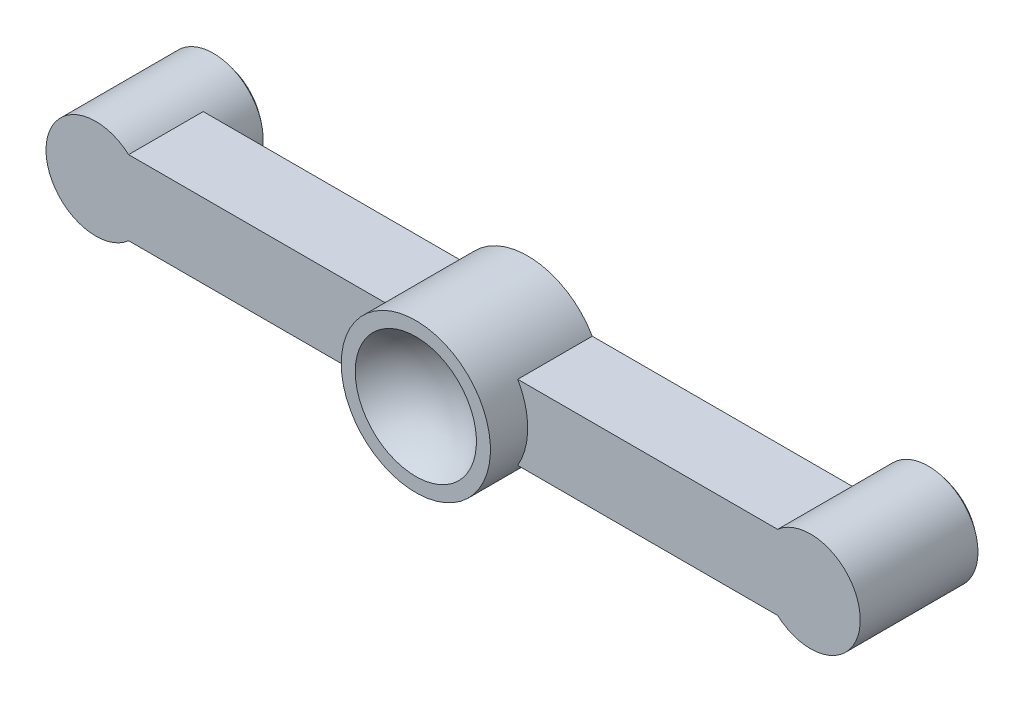
ISO-10303-21;
HEADER;
FILE_DESCRIPTION(('STEP AP214'),'2;1');
FILE_NAME('part.step','',(''),(''),'','','');
FILE_SCHEMA(('AUTOMOTIVE_DESIGN { 1 0 10303 214 1 1 1 1 }'));
ENDSEC;
DATA;
#1=APPLICATION_CONTEXT('core data for automotive mechanical design processes');
#2=APPLICATION_PROTOCOL_DEFINITION('international standard','automotive_design',2000,#1);
#3=PRODUCT_CONTEXT('',#1,'mechanical');
#4=PRODUCT('Part','Part','',(#3));
#5=PRODUCT_RELATED_PRODUCT_CATEGORY('part','',(#4));
#6=PRODUCT_DEFINITION_FORMATION('','',#4);
#7=PRODUCT_DEFINITION_CONTEXT('part definition',#1,'design');
#8=PRODUCT_DEFINITION('design','',#6,#7);
#9=PRODUCT_DEFINITION_SHAPE('','',#8);
#10=(LENGTH_UNIT() NAMED_UNIT(*) SI_UNIT(.MILLI.,.METRE.));
#11=(NAMED_UNIT(*) PLANE_ANGLE_UNIT() SI_UNIT($,.RADIAN.));
#12=(NAMED_UNIT(*) SI_UNIT($,.STERADIAN.) SOLID_ANGLE_UNIT());
#13=UNCERTAINTY_MEASURE_WITH_UNIT(LENGTH_MEASURE(1.E-05),#10,'distance_accuracy_value','');
#14=(GEOMETRIC_REPRESENTATION_CONTEXT(3) GLOBAL_UNCERTAINTY_ASSIGNED_CONTEXT((#13)) GLOBAL_UNIT_ASSIGNED_CONTEXT((#10,
#11,#12)) REPRESENTATION_CONTEXT('',''));
#15=CARTESIAN_POINT('',(0.,0.,0.));
#16=DIRECTION('',(0.,0.,1.));
#17=DIRECTION('',(1.,0.,0.));
#18=AXIS2_PLACEMENT_3D('',#15,#16,#17);
#19=CARTESIAN_POINT('',(0.,0.,12.));
#20=DIRECTION('',(0.,0.,1.));
#21=DIRECTION('',(1.,0.,0.));
#22=AXIS2_PLACEMENT_3D('',#19,#20,#21);
#23=PLANE('',#22);
#24=DIRECTION('',(1.,0.,0.));
#25=VECTOR('',#24,1.);
#26=CARTESIAN_POINT('',(0.,5.99999999999999,12.));
#27=LINE('',#26,#25);
#28=CARTESIAN_POINT('',(67.8923048454133,6.,12.));
#29=VERTEX_POINT('',#28);
#30=CARTESIAN_POINT('',(109.708497377871,6.00000000000001,12.));
#31=VERTEX_POINT('',#30);
#32=EDGE_CURVE('E156',#29,#31,#27,.T.);
#33=ORIENTED_EDGE('',*,*,#32,.F.);
#34=CARTESIAN_POINT('',(57.5,0.,12.));
#35=DIRECTION('',(0.,0.,-1.));
#36=DIRECTION('',(-1.,0.,0.));
#37=AXIS2_PLACEMENT_3D('',#34,#35,#36);
#38=CIRCLE('',#37,12.);
#39=CARTESIAN_POINT('',(67.8923048454133,-5.99999999999999,12.));
#40=VERTEX_POINT('',#39);
#41=EDGE_CURVE('E12',#29,#40,#38,.T.);
#42=ORIENTED_EDGE('',*,*,#41,.T.);
#43=DIRECTION('',(1.,0.,0.));
#44=VECTOR('',#43,1.);
#45=CARTESIAN_POINT('',(0.,-5.99999999999999,12.));
#46=LINE('',#45,#44);
#47=CARTESIAN_POINT('',(109.708497377871,-5.99999999999999,12.));
#48=VERTEX_POINT('',#47);
#49=EDGE_CURVE('E155',#40,#48,#46,.T.);
#50=ORIENTED_EDGE('',*,*,#49,.T.);
#51=CARTESIAN_POINT('',(115.,0.,12.));
#52=DIRECTION('',(0.,0.,1.));
#53=DIRECTION('',(1.,0.,0.));
#54=AXIS2_PLACEMENT_3D('',#51,#52,#53);
#55=CIRCLE('',#54,8.);
#56=EDGE_CURVE('E172',#48,#31,#55,.T.);
#57=ORIENTED_EDGE('',*,*,#56,.T.);
#58=EDGE_LOOP('',(#33,#42,#50,#57));
#59=FACE_BOUND('',#58,.T.);
#60=ADVANCED_FACE('F81',(#59),#23,.T.);
#61=CARTESIAN_POINT('',(0.,0.,0.));
#62=DIRECTION('',(0.,0.,1.));
#63=DIRECTION('',(1.,0.,0.));
#64=AXIS2_PLACEMENT_3D('',#61,#62,#63);
#65=PLANE('',#64);
#66=CARTESIAN_POINT('',(115.,0.,0.));
#67=DIRECTION('',(0.,0.,1.));
#68=DIRECTION('',(1.,0.,0.));
#69=AXIS2_PLACEMENT_3D('',#66,#67,#68);
#70=CIRCLE('',#69,8.);
#71=CARTESIAN_POINT('',(109.708497377871,6.00000000000001,0.));
#72=VERTEX_POINT('',#71);
#73=CARTESIAN_POINT('',(109.708497377871,-5.99999999999999,0.));
#74=VERTEX_POINT('',#73);
#75=EDGE_CURVE('E203',#72,#74,#70,.T.);
#76=ORIENTED_EDGE('',*,*,#75,.T.);
#77=DIRECTION('',(1.,0.,0.));
#78=VECTOR('',#77,1.);
#79=CARTESIAN_POINT('',(0.,-5.99999999999999,0.));
#80=LINE('',#79,#78);
#81=CARTESIAN_POINT('',(67.8923048454133,-5.99999999999999,0.));
#82=VERTEX_POINT('',#81);
#83=EDGE_CURVE('E187',#82,#74,#80,.T.);
#84=ORIENTED_EDGE('',*,*,#83,.F.);
#85=CARTESIAN_POINT('',(57.5,0.,0.));
#86=DIRECTION('',(0.,0.,1.));
#87=DIRECTION('',(1.,0.,0.));
#88=AXIS2_PLACEMENT_3D('',#85,#86,#87);
#89=CIRCLE('',#88,12.);
#90=CARTESIAN_POINT('',(47.1076951545867,-5.99999999999999,0.));
#91=VERTEX_POINT('',#90);
#92=EDGE_CURVE('E201',#91,#82,#89,.T.);
#93=ORIENTED_EDGE('',*,*,#92,.F.);
#94=CARTESIAN_POINT('',(5.2915026221292,-5.99999999999999,0.));
#95=VERTEX_POINT('',#94);
#96=EDGE_CURVE('E189',#95,#91,#80,.T.);
#97=ORIENTED_EDGE('',*,*,#96,.F.);
#98=CARTESIAN_POINT('',(0.,0.,0.));
#99=DIRECTION('',(0.,0.,-1.));
#100=DIRECTION('',(-1.,0.,0.));
#101=AXIS2_PLACEMENT_3D('',#98,#99,#100);
#102=CIRCLE('',#101,8.);
#103=CARTESIAN_POINT('',(5.2915026221292,5.99999999999999,0.));
#104=VERTEX_POINT('',#103);
#105=EDGE_CURVE('E223',#104,#95,#102,.T.);
#106=ORIENTED_EDGE('',*,*,#105,.F.);
#107=DIRECTION('',(1.,0.,0.));
#108=VECTOR('',#107,1.);
#109=CARTESIAN_POINT('',(0.,5.99999999999999,0.));
#110=LINE('',#109,#108);
#111=CARTESIAN_POINT('',(47.1076951545867,6.,0.));
#112=VERTEX_POINT('',#111);
#113=EDGE_CURVE('E186',#104,#112,#110,.T.);
#114=ORIENTED_EDGE('',*,*,#113,.T.);
#115=CARTESIAN_POINT('',(67.8923048454133,6.,0.));
#116=VERTEX_POINT('',#115);
#117=EDGE_CURVE('E160',#116,#112,#89,.T.);
#118=ORIENTED_EDGE('',*,*,#117,.F.);
#119=EDGE_CURVE('E188',#116,#72,#110,.T.);
#120=ORIENTED_EDGE('',*,*,#119,.T.);
#121=EDGE_LOOP('',(#76,#84,#93,#97,#106,#114,#118,#120));
#122=FACE_BOUND('',#121,.T.);
#123=ADVANCED_FACE('F200',(#122),#65,.F.);
#124=CARTESIAN_POINT('',(5.2915026221292,-5.99999999999999,12.));
#125=VERTEX_POINT('',#124);
#126=CARTESIAN_POINT('',(47.1076951545867,-5.99999999999999,12.));
#127=VERTEX_POINT('',#126);
#128=EDGE_CURVE('E143',#125,#127,#46,.T.);
#129=ORIENTED_EDGE('',*,*,#128,.T.);
#130=CARTESIAN_POINT('',(47.1076951545867,6.,12.));
#131=VERTEX_POINT('',#130);
#132=EDGE_CURVE('E91',#127,#131,#38,.T.);
#133=ORIENTED_EDGE('',*,*,#132,.T.);
#134=CARTESIAN_POINT('',(5.29150262212919,5.99999999999999,12.));
#135=VERTEX_POINT('',#134);
#136=EDGE_CURVE('E141',#135,#131,#27,.T.);
#137=ORIENTED_EDGE('',*,*,#136,.F.);
#138=CARTESIAN_POINT('',(0.,0.,12.));
#139=DIRECTION('',(0.,0.,1.));
#140=DIRECTION('',(1.,0.,0.));
#141=AXIS2_PLACEMENT_3D('',#138,#139,#140);
#142=CIRCLE('',#141,8.);
#143=EDGE_CURVE('E176',#135,#125,#142,.T.);
#144=ORIENTED_EDGE('',*,*,#143,.T.);
#145=EDGE_LOOP('',(#129,#133,#137,#144));
#146=FACE_BOUND('',#145,.T.);
#147=ADVANCED_FACE('F139',(#146),#23,.T.);
#148=CARTESIAN_POINT('',(0.,0.,12.));
#149=DIRECTION('',(0.,0.,-1.));
#150=DIRECTION('',(-1.,0.,0.));
#151=AXIS2_PLACEMENT_3D('',#148,#149,#150);
#152=CYLINDRICAL_SURFACE('',#151,8.);
#153=ORIENTED_EDGE('',*,*,#143,.F.);
#154=DIRECTION('',(0.,0.,-1.));
#155=VECTOR('',#154,1.);
#156=CARTESIAN_POINT('',(5.29150262212919,5.99999999999999,12.));
#157=LINE('',#156,#155);
#158=EDGE_CURVE('E85',#135,#104,#157,.T.);
#159=ORIENTED_EDGE('',*,*,#158,.T.);
#160=ORIENTED_EDGE('',*,*,#105,.T.);
#161=DIRECTION('',(0.,0.,-1.));
#162=VECTOR('',#161,1.);
#163=CARTESIAN_POINT('',(5.2915026221292,-5.99999999999999,12.));
#164=LINE('',#163,#162);
#165=EDGE_CURVE('E100',#125,#95,#164,.T.);
#166=ORIENTED_EDGE('',*,*,#165,.F.);
#167=EDGE_LOOP('',(#153,#159,#160,#166));
#168=FACE_BOUND('',#167,.T.);
#169=CARTESIAN_POINT('',(0.,0.,-6.94427190999916));
#170=DIRECTION('',(0.,0.,-1.));
#171=DIRECTION('',(-1.,0.,0.));
#172=AXIS2_PLACEMENT_3D('',#169,#170,#171);
#173=CIRCLE('',#172,8.);
#174=CARTESIAN_POINT('',(-8.,0.,-6.94427190999916));
#175=VERTEX_POINT('',#174);
#176=EDGE_CURVE('E182',#175,#175,#173,.T.);
#177=ORIENTED_EDGE('',*,*,#176,.F.);
#178=EDGE_LOOP('',(#177));
#179=FACE_BOUND('',#178,.T.);
#180=ADVANCED_FACE('F224',(#168,#179),#152,.T.);
#181=CARTESIAN_POINT('',(115.,0.,12.));
#182=DIRECTION('',(0.,0.,-1.));
#183=DIRECTION('',(-1.,0.,0.));
#184=AXIS2_PLACEMENT_3D('',#181,#182,#183);
#185=CYLINDRICAL_SURFACE('',#184,8.);
#186=DIRECTION('',(0.,0.,-1.));
#187=VECTOR('',#186,1.);
#188=CARTESIAN_POINT('',(109.708497377871,-5.99999999999999,12.));
#189=LINE('',#188,#187);
#190=EDGE_CURVE('E173',#74,#48,#189,.F.);
#191=ORIENTED_EDGE('',*,*,#190,.F.);
#192=ORIENTED_EDGE('',*,*,#75,.F.);
#193=DIRECTION('',(0.,0.,-1.));
#194=VECTOR('',#193,1.);
#195=CARTESIAN_POINT('',(109.708497377871,6.00000000000001,12.));
#196=LINE('',#195,#194);
#197=EDGE_CURVE('E175',#72,#31,#196,.F.);
#198=ORIENTED_EDGE('',*,*,#197,.T.);
#199=ORIENTED_EDGE('',*,*,#56,.F.);
#200=EDGE_LOOP('',(#191,#192,#198,#199));
#201=FACE_BOUND('',#200,.T.);
#202=CARTESIAN_POINT('',(115.,0.,-6.94427190999916));
#203=DIRECTION('',(0.,0.,1.));
#204=DIRECTION('',(1.,0.,0.));
#205=AXIS2_PLACEMENT_3D('',#202,#203,#204);
#206=CIRCLE('',#205,8.);
#207=CARTESIAN_POINT('',(123.,0.,-6.94427190999916));
#208=VERTEX_POINT('',#207);
#209=EDGE_CURVE('E207',#208,#208,#206,.T.);
#210=ORIENTED_EDGE('',*,*,#209,.T.);
#211=EDGE_LOOP('',(#210));
#212=FACE_BOUND('',#211,.T.);
#213=ADVANCED_FACE('F211',(#201,#212),#185,.T.);
#214=CARTESIAN_POINT('',(0.,5.99999999999999,12.));
#215=DIRECTION('',(0.,1.,0.));
#216=DIRECTION('',(-1.,0.,0.));
#217=AXIS2_PLACEMENT_3D('',#214,#215,#216);
#218=PLANE('',#217);
#219=ORIENTED_EDGE('',*,*,#197,.F.);
#220=ORIENTED_EDGE('',*,*,#119,.F.);
#221=DIRECTION('',(0.,0.,-1.));
#222=VECTOR('',#221,1.);
#223=CARTESIAN_POINT('',(67.8923048454133,6.,12.));
#224=LINE('',#223,#222);
#225=EDGE_CURVE('E161',#116,#29,#224,.F.);
#226=ORIENTED_EDGE('',*,*,#225,.T.);
#227=ORIENTED_EDGE('',*,*,#32,.T.);
#228=EDGE_LOOP('',(#219,#220,#226,#227));
#229=FACE_BOUND('',#228,.T.);
#230=ADVANCED_FACE('F268',(#229),#218,.T.);
#231=CARTESIAN_POINT('',(0.,-5.99999999999999,12.));
#232=DIRECTION('',(0.,1.,0.));
#233=DIRECTION('',(0.,0.,1.));
#234=AXIS2_PLACEMENT_3D('',#231,#232,#233);
#235=PLANE('',#234);
#236=ORIENTED_EDGE('',*,*,#83,.T.);
#237=ORIENTED_EDGE('',*,*,#190,.T.);
#238=ORIENTED_EDGE('',*,*,#49,.F.);
#239=DIRECTION('',(0.,0.,-1.));
#240=VECTOR('',#239,1.);
#241=CARTESIAN_POINT('',(67.8923048454133,-5.99999999999999,12.));
#242=LINE('',#241,#240);
#243=EDGE_CURVE('E131',#82,#40,#242,.F.);
#244=ORIENTED_EDGE('',*,*,#243,.F.);
#245=EDGE_LOOP('',(#236,#237,#238,#244));
#246=FACE_BOUND('',#245,.T.);
#247=ADVANCED_FACE('F193',(#246),#235,.F.);
#248=CARTESIAN_POINT('',(57.5,0.,12.));
#249=DIRECTION('',(0.,0.,-1.));
#250=DIRECTION('',(-1.,0.,0.));
#251=AXIS2_PLACEMENT_3D('',#248,#249,#250);
#252=CYLINDRICAL_SURFACE('',#251,12.);
#253=ORIENTED_EDGE('',*,*,#225,.F.);
#254=ORIENTED_EDGE('',*,*,#117,.T.);
#255=DIRECTION('',(0.,0.,-1.));
#256=VECTOR('',#255,1.);
#257=CARTESIAN_POINT('',(47.1076951545867,6.,12.));
#258=LINE('',#257,#256);
#259=EDGE_CURVE('E152',#131,#112,#258,.T.);
#260=ORIENTED_EDGE('',*,*,#259,.F.);
#261=ORIENTED_EDGE('',*,*,#132,.F.);
#262=DIRECTION('',(0.,0.,-1.));
#263=VECTOR('',#262,1.);
#264=CARTESIAN_POINT('',(47.1076951545867,-5.99999999999999,12.));
#265=LINE('',#264,#263);
#266=EDGE_CURVE('E164',#127,#91,#265,.T.);
#267=ORIENTED_EDGE('',*,*,#266,.T.);
#268=ORIENTED_EDGE('',*,*,#92,.T.);
#269=ORIENTED_EDGE('',*,*,#243,.T.);
#270=ORIENTED_EDGE('',*,*,#41,.F.);
#271=EDGE_LOOP('',(#253,#254,#260,#261,#267,#268,#269,#270));
#272=FACE_BOUND('',#271,.T.);
#273=CARTESIAN_POINT('',(57.5,0.,18.));
#274=DIRECTION('',(0.,0.,-1.));
#275=DIRECTION('',(-1.,0.,0.));
#276=AXIS2_PLACEMENT_3D('',#273,#274,#275);
#277=CIRCLE('',#276,12.);
#278=CARTESIAN_POINT('',(45.5,0.,18.));
#279=VERTEX_POINT('',#278);
#280=EDGE_CURVE('E208',#279,#279,#277,.T.);
#281=ORIENTED_EDGE('',*,*,#280,.T.);
#282=EDGE_LOOP('',(#281));
#283=FACE_BOUND('',#282,.T.);
#284=ADVANCED_FACE('F83',(#272,#283),#252,.T.);
#285=ORIENTED_EDGE('',*,*,#158,.F.);
#286=ORIENTED_EDGE('',*,*,#136,.T.);
#287=ORIENTED_EDGE('',*,*,#259,.T.);
#288=ORIENTED_EDGE('',*,*,#113,.F.);
#289=EDGE_LOOP('',(#285,#286,#287,#288));
#290=FACE_BOUND('',#289,.T.);
#291=ADVANCED_FACE('F150',(#290),#218,.T.);
#292=ORIENTED_EDGE('',*,*,#128,.F.);
#293=ORIENTED_EDGE('',*,*,#165,.T.);
#294=ORIENTED_EDGE('',*,*,#96,.T.);
#295=ORIENTED_EDGE('',*,*,#266,.F.);
#296=EDGE_LOOP('',(#292,#293,#294,#295));
#297=FACE_BOUND('',#296,.T.);
#298=ADVANCED_FACE('F261',(#297),#235,.F.);
#299=CARTESIAN_POINT('',(0.,0.,2.));
#300=DIRECTION('',(0.,0.,-1.));
#301=DIRECTION('',(-1.,0.,0.));
#302=AXIS2_PLACEMENT_3D('',#299,#300,#301);
#303=SPHERICAL_SURFACE('',#302,12.);
#304=ORIENTED_EDGE('',*,*,#176,.T.);
#305=EDGE_LOOP('',(#304));
#306=FACE_BOUND('',#305,.T.);
#307=ADVANCED_FACE('F255',(#306),#303,.T.);
#308=CARTESIAN_POINT('',(115.,0.,2.));
#309=DIRECTION('',(0.,0.,-1.));
#310=DIRECTION('',(1.,0.,0.));
#311=AXIS2_PLACEMENT_3D('',#308,#309,#310);
#312=SPHERICAL_SURFACE('',#311,12.);
#313=ORIENTED_EDGE('',*,*,#209,.F.);
#314=EDGE_LOOP('',(#313));
#315=FACE_BOUND('',#314,.T.);
#316=ADVANCED_FACE('F245',(#315),#312,.T.);
#317=CARTESIAN_POINT('',(47.753205655191,0.,18.));
#318=DIRECTION('',(0.,0.,1.));
#319=DIRECTION('',(1.,0.,0.));
#320=AXIS2_PLACEMENT_3D('',#317,#318,#319);
#321=PLANE('',#320);
#322=CARTESIAN_POINT('',(57.5,0.,18.));
#323=DIRECTION('',(0.,0.,-1.));
#324=DIRECTION('',(-1.,0.,0.));
#325=AXIS2_PLACEMENT_3D('',#322,#323,#324);
#326=CIRCLE('',#325,9.74679434480896);
#327=CARTESIAN_POINT('',(47.753205655191,0.,18.));
#328=VERTEX_POINT('',#327);
#329=EDGE_CURVE('E232',#328,#328,#326,.T.);
#330=ORIENTED_EDGE('',*,*,#329,.T.);
#331=EDGE_LOOP('',(#330));
#332=FACE_BOUND('',#331,.T.);
#333=ORIENTED_EDGE('',*,*,#280,.F.);
#334=EDGE_LOOP('',(#333));
#335=FACE_BOUND('',#334,.T.);
#336=ADVANCED_FACE('F236',(#332,#335),#321,.T.);
#337=CARTESIAN_POINT('',(57.5,0.,25.));
#338=DIRECTION('',(0.,0.,-1.));
#339=DIRECTION('',(-1.,0.,0.));
#340=AXIS2_PLACEMENT_3D('',#337,#338,#339);
#341=SPHERICAL_SURFACE('',#340,12.);
#342=ORIENTED_EDGE('',*,*,#329,.F.);
#343=EDGE_LOOP('',(#342));
#344=FACE_BOUND('',#343,.T.);
#345=ADVANCED_FACE('F239',(#344),#341,.F.);
#346=CLOSED_SHELL('',(#60,#123,#147,#180,#213,#230,#247,#284,#291,#298,#307,#316,#336,#345));
#347=MANIFOLD_SOLID_BREP('B2',#346);
#348=ADVANCED_BREP_SHAPE_REPRESENTATION('',(#18,#347),#14);
#349=SHAPE_DEFINITION_REPRESENTATION(#9,#348);
ENDSEC;
END-ISO-10303-21;
